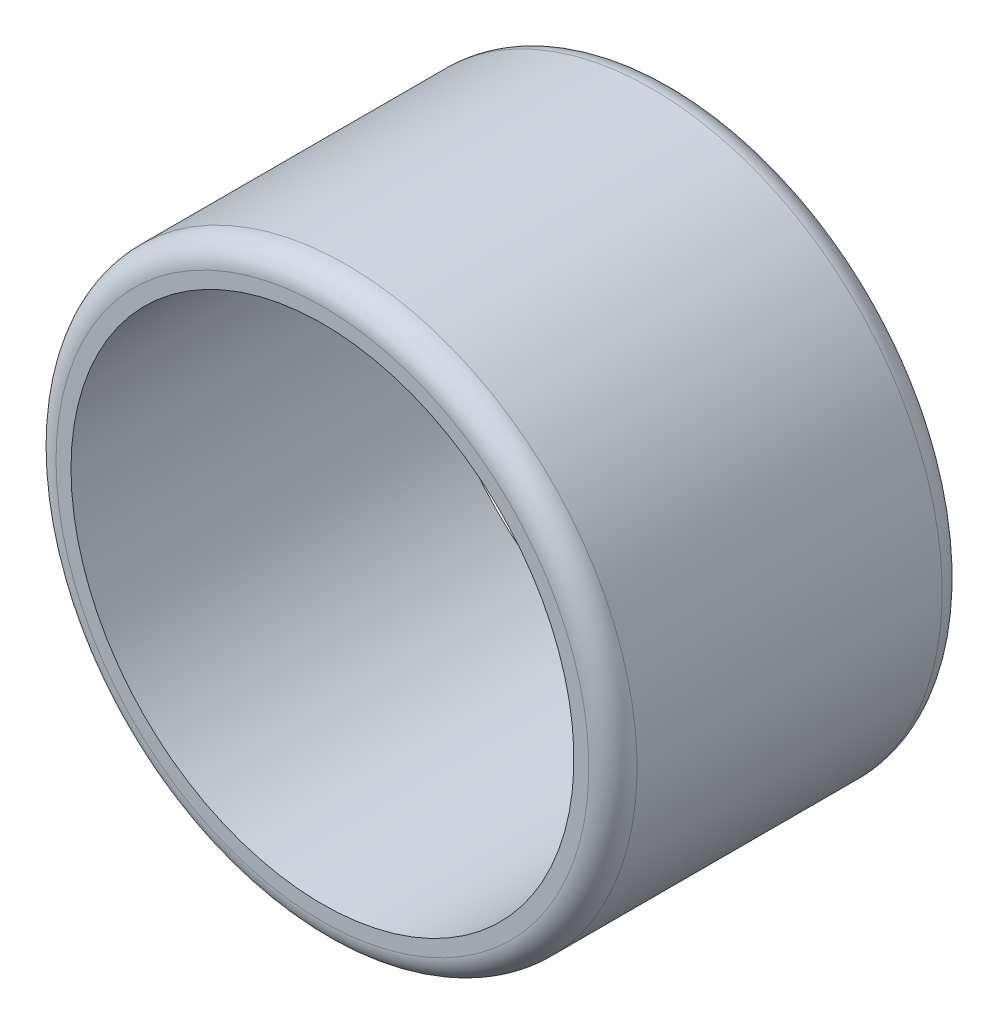
ISO-10303-21;
HEADER;
FILE_DESCRIPTION(('STEP AP214'),'2;1');
FILE_NAME('part.step','',(''),(''),'','','');
FILE_SCHEMA(('AUTOMOTIVE_DESIGN { 1 0 10303 214 1 1 1 1 }'));
ENDSEC;
DATA;
#1=APPLICATION_CONTEXT('core data for automotive mechanical design processes');
#2=APPLICATION_PROTOCOL_DEFINITION('international standard','automotive_design',2000,#1);
#3=PRODUCT_CONTEXT('',#1,'mechanical');
#4=PRODUCT('Part','Part','',(#3));
#5=PRODUCT_RELATED_PRODUCT_CATEGORY('part','',(#4));
#6=PRODUCT_DEFINITION_FORMATION('','',#4);
#7=PRODUCT_DEFINITION_CONTEXT('part definition',#1,'design');
#8=PRODUCT_DEFINITION('design','',#6,#7);
#9=PRODUCT_DEFINITION_SHAPE('','',#8);
#10=(LENGTH_UNIT() NAMED_UNIT(*) SI_UNIT(.MILLI.,.METRE.));
#11=(NAMED_UNIT(*) PLANE_ANGLE_UNIT() SI_UNIT($,.RADIAN.));
#12=(NAMED_UNIT(*) SI_UNIT($,.STERADIAN.) SOLID_ANGLE_UNIT());
#13=UNCERTAINTY_MEASURE_WITH_UNIT(LENGTH_MEASURE(1.E-05),#10,'distance_accuracy_value','');
#14=(GEOMETRIC_REPRESENTATION_CONTEXT(3) GLOBAL_UNCERTAINTY_ASSIGNED_CONTEXT((#13)) GLOBAL_UNIT_ASSIGNED_CONTEXT((#10,
#11,#12)) REPRESENTATION_CONTEXT('',''));
#15=CARTESIAN_POINT('',(0.,0.,0.));
#16=DIRECTION('',(0.,0.,1.));
#17=DIRECTION('',(1.,0.,0.));
#18=AXIS2_PLACEMENT_3D('',#15,#16,#17);
#19=CARTESIAN_POINT('',(2179.59090909091,2825.,5208.1848110498));
#20=DIRECTION('',(0.,0.,-1.));
#21=DIRECTION('',(0.,-1.,0.));
#22=AXIS2_PLACEMENT_3D('',#19,#20,#21);
#23=CYLINDRICAL_SURFACE('',#22,904.406833613603);
#24=CARTESIAN_POINT('',(2179.59090909091,2825.,4183.1848110498));
#25=DIRECTION('',(0.,0.,-1.));
#26=DIRECTION('',(-1.,0.,0.));
#27=AXIS2_PLACEMENT_3D('',#24,#25,#26);
#28=CIRCLE('',#27,904.406833613603);
#29=CARTESIAN_POINT('',(1275.18407547731,2825.,4183.1848110498));
#30=VERTEX_POINT('',#29);
#31=EDGE_CURVE('E25',#30,#30,#28,.F.);
#32=ORIENTED_EDGE('',*,*,#31,.T.);
#33=EDGE_LOOP('',(#32));
#34=FACE_BOUND('',#33,.T.);
#35=CARTESIAN_POINT('',(2179.59090909091,2825.,5133.1848110498));
#36=DIRECTION('',(0.,0.,-1.));
#37=DIRECTION('',(-1.,0.,0.));
#38=AXIS2_PLACEMENT_3D('',#35,#36,#37);
#39=CIRCLE('',#38,904.406833613603);
#40=CARTESIAN_POINT('',(1275.18407547731,2825.,5133.1848110498));
#41=VERTEX_POINT('',#40);
#42=EDGE_CURVE('E29',#41,#41,#39,.T.);
#43=ORIENTED_EDGE('',*,*,#42,.T.);
#44=EDGE_LOOP('',(#43));
#45=FACE_BOUND('',#44,.T.);
#46=ADVANCED_FACE('F15',(#34,#45),#23,.T.);
#47=CARTESIAN_POINT('',(2179.59090909091,2825.,5208.1848110498));
#48=DIRECTION('',(0.,0.,-1.));
#49=DIRECTION('',(0.,-1.,0.));
#50=AXIS2_PLACEMENT_3D('',#47,#48,#49);
#51=PLANE('',#50);
#52=CARTESIAN_POINT('',(2179.59090909091,2825.,5208.1848110498));
#53=DIRECTION('',(0.,0.,-1.));
#54=DIRECTION('',(-1.,0.,0.));
#55=AXIS2_PLACEMENT_3D('',#52,#53,#54);
#56=CIRCLE('',#55,829.406833613603);
#57=CARTESIAN_POINT('',(1350.18407547731,2825.,5208.1848110498));
#58=VERTEX_POINT('',#57);
#59=EDGE_CURVE('E10',#58,#58,#56,.F.);
#60=ORIENTED_EDGE('',*,*,#59,.T.);
#61=EDGE_LOOP('',(#60));
#62=FACE_BOUND('',#61,.T.);
#63=CARTESIAN_POINT('',(2179.59090909091,2825.,5208.1848110498));
#64=DIRECTION('',(0.,0.,-1.));
#65=DIRECTION('',(-1.,0.,0.));
#66=AXIS2_PLACEMENT_3D('',#63,#64,#65);
#67=CIRCLE('',#66,782.862069444271);
#68=CARTESIAN_POINT('',(1396.72883964664,2825.,5208.1848110498));
#69=VERTEX_POINT('',#68);
#70=EDGE_CURVE('E34',#69,#69,#67,.T.);
#71=ORIENTED_EDGE('',*,*,#70,.T.);
#72=EDGE_LOOP('',(#71));
#73=FACE_BOUND('',#72,.T.);
#74=ADVANCED_FACE('F41',(#62,#73),#51,.F.);
#75=CARTESIAN_POINT('',(2179.59090909091,2825.,4108.1848110498));
#76=DIRECTION('',(0.,0.,-1.));
#77=DIRECTION('',(0.,-1.,0.));
#78=AXIS2_PLACEMENT_3D('',#75,#76,#77);
#79=PLANE('',#78);
#80=CARTESIAN_POINT('',(2179.59090909091,2825.,4108.1848110498));
#81=DIRECTION('',(0.,0.,-1.));
#82=DIRECTION('',(-1.,0.,0.));
#83=AXIS2_PLACEMENT_3D('',#80,#81,#82);
#84=CIRCLE('',#83,829.406833613603);
#85=CARTESIAN_POINT('',(1350.18407547731,2825.,4108.1848110498));
#86=VERTEX_POINT('',#85);
#87=EDGE_CURVE('E21',#86,#86,#84,.T.);
#88=ORIENTED_EDGE('',*,*,#87,.T.);
#89=EDGE_LOOP('',(#88));
#90=FACE_BOUND('',#89,.T.);
#91=CARTESIAN_POINT('',(2179.59090909091,2825.,4108.1848110498));
#92=DIRECTION('',(0.,0.,-1.));
#93=DIRECTION('',(-1.,0.,0.));
#94=AXIS2_PLACEMENT_3D('',#91,#92,#93);
#95=CIRCLE('',#94,782.862069444271);
#96=CARTESIAN_POINT('',(1396.72883964664,2825.,4108.1848110498));
#97=VERTEX_POINT('',#96);
#98=EDGE_CURVE('E35',#97,#97,#95,.T.);
#99=ORIENTED_EDGE('',*,*,#98,.F.);
#100=EDGE_LOOP('',(#99));
#101=FACE_BOUND('',#100,.T.);
#102=ADVANCED_FACE('F46',(#90,#101),#79,.T.);
#103=CARTESIAN_POINT('',(2179.59090909091,2825.,5408.1848110498));
#104=DIRECTION('',(0.,0.,-1.));
#105=DIRECTION('',(-1.,0.,0.));
#106=AXIS2_PLACEMENT_3D('',#103,#104,#105);
#107=CYLINDRICAL_SURFACE('',#106,782.862069444271);
#108=ORIENTED_EDGE('',*,*,#98,.T.);
#109=EDGE_LOOP('',(#108));
#110=FACE_BOUND('',#109,.T.);
#111=ORIENTED_EDGE('',*,*,#70,.F.);
#112=EDGE_LOOP('',(#111));
#113=FACE_BOUND('',#112,.T.);
#114=ADVANCED_FACE('F43',(#110,#113),#107,.F.);
#115=CARTESIAN_POINT('',(2179.59090909091,2825.,4183.1848110498));
#116=DIRECTION('',(0.,0.,-1.));
#117=DIRECTION('',(-1.,0.,0.));
#118=AXIS2_PLACEMENT_3D('',#115,#116,#117);
#119=TOROIDAL_SURFACE('',#118,829.406833613603,75.);
#120=ORIENTED_EDGE('',*,*,#87,.F.);
#121=EDGE_LOOP('',(#120));
#122=FACE_BOUND('',#121,.T.);
#123=ORIENTED_EDGE('',*,*,#31,.F.);
#124=EDGE_LOOP('',(#123));
#125=FACE_BOUND('',#124,.T.);
#126=ADVANCED_FACE('F45',(#122,#125),#119,.T.);
#127=CARTESIAN_POINT('',(2179.59090909091,2825.,5133.1848110498));
#128=DIRECTION('',(0.,0.,-1.));
#129=DIRECTION('',(-1.,0.,0.));
#130=AXIS2_PLACEMENT_3D('',#127,#128,#129);
#131=TOROIDAL_SURFACE('',#130,829.406833613603,75.);
#132=ORIENTED_EDGE('',*,*,#42,.F.);
#133=EDGE_LOOP('',(#132));
#134=FACE_BOUND('',#133,.T.);
#135=ORIENTED_EDGE('',*,*,#59,.F.);
#136=EDGE_LOOP('',(#135));
#137=FACE_BOUND('',#136,.T.);
#138=ADVANCED_FACE('F54',(#134,#137),#131,.T.);
#139=CLOSED_SHELL('',(#46,#74,#102,#114,#126,#138));
#140=MANIFOLD_SOLID_BREP('B1',#139);
#141=ADVANCED_BREP_SHAPE_REPRESENTATION('',(#18,#140),#14);
#142=SHAPE_DEFINITION_REPRESENTATION(#9,#141);
ENDSEC;
END-ISO-10303-21;
